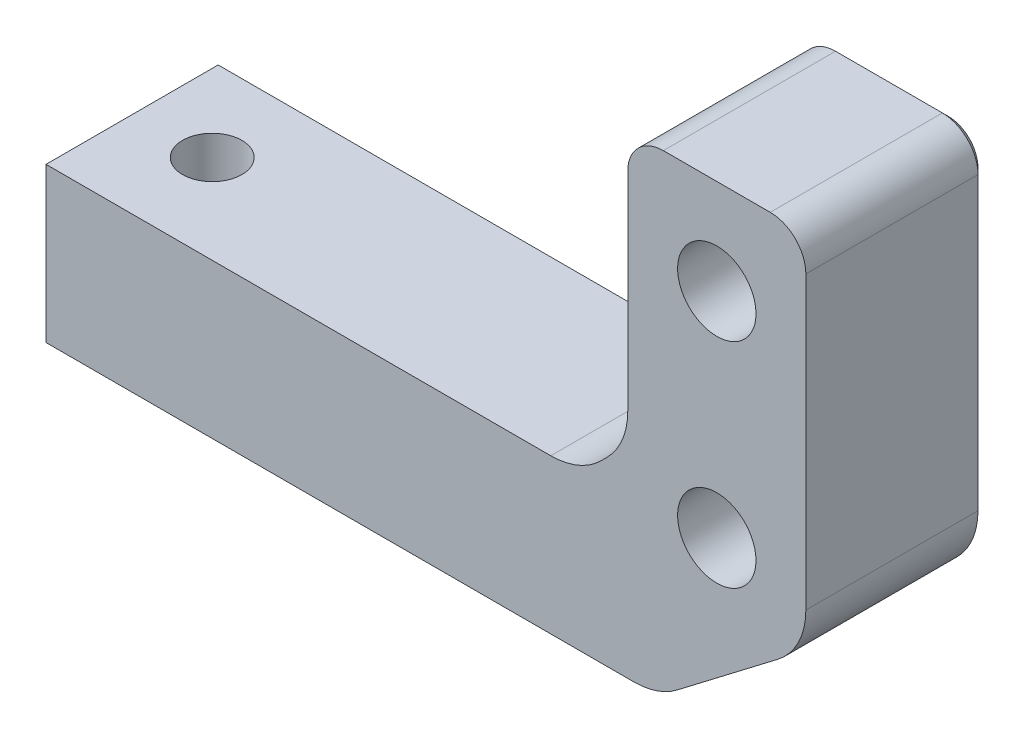
ISO-10303-21;
HEADER;
FILE_DESCRIPTION(('STEP AP214'),'2;1');
FILE_NAME('part.step','',(''),(''),'','','');
FILE_SCHEMA(('AUTOMOTIVE_DESIGN { 1 0 10303 214 1 1 1 1 }'));
ENDSEC;
DATA;
#1=APPLICATION_CONTEXT('core data for automotive mechanical design processes');
#2=APPLICATION_PROTOCOL_DEFINITION('international standard','automotive_design',2000,#1);
#3=PRODUCT_CONTEXT('',#1,'mechanical');
#4=PRODUCT('Part','Part','',(#3));
#5=PRODUCT_RELATED_PRODUCT_CATEGORY('part','',(#4));
#6=PRODUCT_DEFINITION_FORMATION('','',#4);
#7=PRODUCT_DEFINITION_CONTEXT('part definition',#1,'design');
#8=PRODUCT_DEFINITION('design','',#6,#7);
#9=PRODUCT_DEFINITION_SHAPE('','',#8);
#10=(LENGTH_UNIT() NAMED_UNIT(*) SI_UNIT(.MILLI.,.METRE.));
#11=(NAMED_UNIT(*) PLANE_ANGLE_UNIT() SI_UNIT($,.RADIAN.));
#12=(NAMED_UNIT(*) SI_UNIT($,.STERADIAN.) SOLID_ANGLE_UNIT());
#13=UNCERTAINTY_MEASURE_WITH_UNIT(LENGTH_MEASURE(1.E-05),#10,'distance_accuracy_value','');
#14=(GEOMETRIC_REPRESENTATION_CONTEXT(3) GLOBAL_UNCERTAINTY_ASSIGNED_CONTEXT((#13)) GLOBAL_UNIT_ASSIGNED_CONTEXT((#10,
#11,#12)) REPRESENTATION_CONTEXT('',''));
#15=CARTESIAN_POINT('',(0.,0.,0.));
#16=DIRECTION('',(0.,0.,1.));
#17=DIRECTION('',(1.,0.,0.));
#18=AXIS2_PLACEMENT_3D('',#15,#16,#17);
#19=CARTESIAN_POINT('',(19.014718625759,-13.832454105557,30.));
#20=DIRECTION('',(0.,0.,1.));
#21=DIRECTION('',(-1.,0.,0.));
#22=AXIS2_PLACEMENT_3D('',#19,#20,#21);
#23=PLANE('',#22);
#24=DIRECTION('',(0.,-1.,0.));
#25=VECTOR('',#24,1.);
#26=CARTESIAN_POINT('',(-30.4999999999976,-6.83245410555701,30.));
#27=LINE('',#26,#25);
#28=CARTESIAN_POINT('',(-30.4999999999976,-6.83245410555701,30.));
#29=VERTEX_POINT('',#28);
#30=CARTESIAN_POINT('',(-30.4999999999976,-19.832454105557,30.));
#31=VERTEX_POINT('',#30);
#32=EDGE_CURVE('E185',#29,#31,#27,.T.);
#33=ORIENTED_EDGE('',*,*,#32,.T.);
#34=DIRECTION('',(1.,0.,0.));
#35=VECTOR('',#34,1.);
#36=CARTESIAN_POINT('',(-30.4999999999976,-19.832454105557,30.));
#37=LINE('',#36,#35);
#38=CARTESIAN_POINT('',(19.014718625759,-19.832454105557,30.));
#39=VERTEX_POINT('',#38);
#40=EDGE_CURVE('E193',#31,#39,#37,.T.);
#41=ORIENTED_EDGE('',*,*,#40,.T.);
#42=CARTESIAN_POINT('',(19.014718625759,-13.832454105557,30.));
#43=DIRECTION('',(0.,0.,1.));
#44=DIRECTION('',(-1.,0.,0.));
#45=AXIS2_PLACEMENT_3D('',#42,#43,#44);
#46=CIRCLE('',#45,6.00000000000001);
#47=CARTESIAN_POINT('',(22.6581914357032,-18.599539785844,30.));
#48=VERTEX_POINT('',#47);
#49=EDGE_CURVE('E199',#39,#48,#46,.T.);
#50=ORIENTED_EDGE('',*,*,#49,.T.);
#51=DIRECTION('',(0.794514280047827,0.60724546832404,0.));
#52=VECTOR('',#51,1.);
#53=CARTESIAN_POINT('',(22.6581914357032,-18.599539785844,30.));
#54=LINE('',#53,#52);
#55=CARTESIAN_POINT('',(31.1434728099418,-12.1142584116054,30.));
#56=VERTEX_POINT('',#55);
#57=EDGE_CURVE('E214',#48,#56,#54,.T.);
#58=ORIENTED_EDGE('',*,*,#57,.T.);
#59=CARTESIAN_POINT('',(27.4999999999976,-7.34717273131841,30.));
#60=DIRECTION('',(0.,0.,1.));
#61=DIRECTION('',(1.,0.,0.));
#62=AXIS2_PLACEMENT_3D('',#59,#60,#61);
#63=CIRCLE('',#62,6.);
#64=CARTESIAN_POINT('',(33.4999999999976,-7.34717273131841,30.));
#65=VERTEX_POINT('',#64);
#66=EDGE_CURVE('E217',#56,#65,#63,.T.);
#67=ORIENTED_EDGE('',*,*,#66,.T.);
#68=DIRECTION('',(0.,1.,0.));
#69=VECTOR('',#68,1.);
#70=CARTESIAN_POINT('',(33.4999999999976,-7.34717273131841,30.));
#71=LINE('',#70,#69);
#72=CARTESIAN_POINT('',(33.4999999999976,17.167545894443,30.));
#73=VERTEX_POINT('',#72);
#74=EDGE_CURVE('E220',#65,#73,#71,.T.);
#75=ORIENTED_EDGE('',*,*,#74,.T.);
#76=CARTESIAN_POINT('',(30.4999999999976,17.167545894443,30.));
#77=DIRECTION('',(0.,0.,1.));
#78=DIRECTION('',(1.,0.,0.));
#79=AXIS2_PLACEMENT_3D('',#76,#77,#78);
#80=CIRCLE('',#79,3.);
#81=CARTESIAN_POINT('',(30.4999999999976,20.167545894443,30.));
#82=VERTEX_POINT('',#81);
#83=EDGE_CURVE('E223',#73,#82,#80,.T.);
#84=ORIENTED_EDGE('',*,*,#83,.T.);
#85=DIRECTION('',(-1.,0.,0.));
#86=VECTOR('',#85,1.);
#87=CARTESIAN_POINT('',(30.4999999999976,20.167545894443,30.));
#88=LINE('',#87,#86);
#89=CARTESIAN_POINT('',(21.4999999999976,20.167545894443,30.));
#90=VERTEX_POINT('',#89);
#91=EDGE_CURVE('E226',#82,#90,#88,.T.);
#92=ORIENTED_EDGE('',*,*,#91,.T.);
#93=CARTESIAN_POINT('',(21.4999999999976,17.167545894443,30.));
#94=DIRECTION('',(0.,0.,1.));
#95=DIRECTION('',(1.,0.,0.));
#96=AXIS2_PLACEMENT_3D('',#93,#94,#95);
#97=CIRCLE('',#96,3.);
#98=CARTESIAN_POINT('',(18.4999999999976,17.167545894443,30.));
#99=VERTEX_POINT('',#98);
#100=EDGE_CURVE('E229',#90,#99,#97,.T.);
#101=ORIENTED_EDGE('',*,*,#100,.T.);
#102=DIRECTION('',(0.,-1.,0.));
#103=VECTOR('',#102,1.);
#104=CARTESIAN_POINT('',(18.4999999999976,-0.347172731318424,30.));
#105=LINE('',#104,#103);
#106=CARTESIAN_POINT('',(18.4999999999976,-0.347172731318424,30.));
#107=VERTEX_POINT('',#106);
#108=EDGE_CURVE('E232',#99,#107,#105,.T.);
#109=ORIENTED_EDGE('',*,*,#108,.T.);
#110=CARTESIAN_POINT('',(12.4999999999976,-0.347172731318424,30.));
#111=DIRECTION('',(0.,0.,-1.));
#112=DIRECTION('',(1.,0.,0.));
#113=AXIS2_PLACEMENT_3D('',#110,#111,#112);
#114=CIRCLE('',#113,6.);
#115=CARTESIAN_POINT('',(16.7426406871169,-4.58981341843767,30.));
#116=VERTEX_POINT('',#115);
#117=EDGE_CURVE('E235',#107,#116,#114,.T.);
#118=ORIENTED_EDGE('',*,*,#117,.T.);
#119=DIRECTION('',(-0.707106781186538,-0.707106781186557,0.));
#120=VECTOR('',#119,1.);
#121=CARTESIAN_POINT('',(16.2573593128783,-5.07509479267625,30.));
#122=LINE('',#121,#120);
#123=CARTESIAN_POINT('',(16.2573593128783,-5.07509479267625,30.));
#124=VERTEX_POINT('',#123);
#125=EDGE_CURVE('E238',#116,#124,#122,.T.);
#126=ORIENTED_EDGE('',*,*,#125,.T.);
#127=CARTESIAN_POINT('',(12.014718625759,-0.832454105557007,30.));
#128=DIRECTION('',(0.,0.,-1.));
#129=DIRECTION('',(-1.,0.,0.));
#130=AXIS2_PLACEMENT_3D('',#127,#128,#129);
#131=CIRCLE('',#130,6.);
#132=CARTESIAN_POINT('',(12.014718625759,-6.83245410555701,30.));
#133=VERTEX_POINT('',#132);
#134=EDGE_CURVE('E241',#124,#133,#131,.T.);
#135=ORIENTED_EDGE('',*,*,#134,.T.);
#136=DIRECTION('',(-1.,0.,0.));
#137=VECTOR('',#136,1.);
#138=CARTESIAN_POINT('',(-30.4999999999976,-6.83245410555701,30.));
#139=LINE('',#138,#137);
#140=EDGE_CURVE('E205',#133,#29,#139,.T.);
#141=ORIENTED_EDGE('',*,*,#140,.T.);
#142=EDGE_LOOP('',(#33,#41,#50,#58,#67,#75,#84,#92,#101,#109,#118,#126,#135,#141));
#143=FACE_BOUND('',#142,.T.);
#144=CARTESIAN_POINT('',(25.9999999999976,-5.83245410555701,30.));
#145=DIRECTION('',(0.,0.,1.));
#146=DIRECTION('',(1.,0.,0.));
#147=AXIS2_PLACEMENT_3D('',#144,#145,#146);
#148=CIRCLE('',#147,3.3);
#149=CARTESIAN_POINT('',(29.2999999999976,-5.83245410555701,30.));
#150=VERTEX_POINT('',#149);
#151=EDGE_CURVE('E206',#150,#150,#148,.T.);
#152=ORIENTED_EDGE('',*,*,#151,.F.);
#153=EDGE_LOOP('',(#152));
#154=FACE_BOUND('',#153,.T.);
#155=CARTESIAN_POINT('',(25.9999999999976,12.167545894443,30.));
#156=DIRECTION('',(0.,0.,1.));
#157=DIRECTION('',(1.,0.,0.));
#158=AXIS2_PLACEMENT_3D('',#155,#156,#157);
#159=CIRCLE('',#158,3.3);
#160=CARTESIAN_POINT('',(29.2999999999976,12.167545894443,30.));
#161=VERTEX_POINT('',#160);
#162=EDGE_CURVE('E394',#161,#161,#159,.T.);
#163=ORIENTED_EDGE('',*,*,#162,.F.);
#164=EDGE_LOOP('',(#163));
#165=FACE_BOUND('',#164,.T.);
#166=ADVANCED_FACE('F34',(#143,#154,#165),#23,.T.);
#167=CARTESIAN_POINT('',(19.014718625759,-13.832454105557,15.));
#168=DIRECTION('',(0.,0.,1.));
#169=DIRECTION('',(-1.,0.,0.));
#170=AXIS2_PLACEMENT_3D('',#167,#168,#169);
#171=PLANE('',#170);
#172=CARTESIAN_POINT('',(25.9999999999976,12.167545894443,15.));
#173=DIRECTION('',(0.,0.,-1.));
#174=DIRECTION('',(-1.,0.,0.));
#175=AXIS2_PLACEMENT_3D('',#172,#173,#174);
#176=CIRCLE('',#175,6.);
#177=CARTESIAN_POINT('',(19.9999999999976,12.167545894443,15.));
#178=VERTEX_POINT('',#177);
#179=EDGE_CURVE('E314',#178,#178,#176,.T.);
#180=ORIENTED_EDGE('',*,*,#179,.F.);
#181=EDGE_LOOP('',(#180));
#182=FACE_BOUND('',#181,.T.);
#183=CARTESIAN_POINT('',(25.9999999999976,-5.83245410555701,15.));
#184=DIRECTION('',(0.,0.,-1.));
#185=DIRECTION('',(-1.,0.,0.));
#186=AXIS2_PLACEMENT_3D('',#183,#184,#185);
#187=CIRCLE('',#186,5.99999999999999);
#188=CARTESIAN_POINT('',(19.9999999999976,-5.83245410555701,15.));
#189=VERTEX_POINT('',#188);
#190=EDGE_CURVE('E311',#189,#189,#187,.T.);
#191=ORIENTED_EDGE('',*,*,#190,.F.);
#192=EDGE_LOOP('',(#191));
#193=FACE_BOUND('',#192,.T.);
#194=DIRECTION('',(0.,-1.,0.));
#195=VECTOR('',#194,1.);
#196=CARTESIAN_POINT('',(-29.9999999999976,-13.832454105557,15.));
#197=LINE('',#196,#195);
#198=CARTESIAN_POINT('',(-29.9999999999976,-7.33245410555701,15.));
#199=VERTEX_POINT('',#198);
#200=CARTESIAN_POINT('',(-29.9999999999976,-19.332454105557,15.));
#201=VERTEX_POINT('',#200);
#202=EDGE_CURVE('E273',#199,#201,#197,.T.);
#203=ORIENTED_EDGE('',*,*,#202,.F.);
#204=DIRECTION('',(-1.,0.,0.));
#205=VECTOR('',#204,1.);
#206=CARTESIAN_POINT('',(19.014718625759,-7.33245410555701,15.));
#207=LINE('',#206,#205);
#208=CARTESIAN_POINT('',(12.014718625759,-7.33245410555701,15.));
#209=VERTEX_POINT('',#208);
#210=EDGE_CURVE('E271',#209,#199,#207,.T.);
#211=ORIENTED_EDGE('',*,*,#210,.F.);
#212=CARTESIAN_POINT('',(12.014718625759,-0.832454105557007,15.));
#213=DIRECTION('',(0.,0.,-1.));
#214=DIRECTION('',(-1.,0.,0.));
#215=AXIS2_PLACEMENT_3D('',#212,#213,#214);
#216=CIRCLE('',#215,6.5);
#217=CARTESIAN_POINT('',(16.6109127034716,-5.42864818326952,15.));
#218=VERTEX_POINT('',#217);
#219=EDGE_CURVE('E276',#218,#209,#216,.T.);
#220=ORIENTED_EDGE('',*,*,#219,.F.);
#221=DIRECTION('',(-0.707106781186538,-0.707106781186557,0.));
#222=VECTOR('',#221,1.);
#223=CARTESIAN_POINT('',(13.6109127034715,-8.42864818326968,15.));
#224=LINE('',#223,#222);
#225=CARTESIAN_POINT('',(17.0961940777102,-4.94336680903094,15.));
#226=VERTEX_POINT('',#225);
#227=EDGE_CURVE('E278',#226,#218,#224,.T.);
#228=ORIENTED_EDGE('',*,*,#227,.F.);
#229=CARTESIAN_POINT('',(12.4999999999976,-0.347172731318424,15.));
#230=DIRECTION('',(0.,0.,-1.));
#231=DIRECTION('',(-1.,0.,0.));
#232=AXIS2_PLACEMENT_3D('',#229,#230,#231);
#233=CIRCLE('',#232,6.5);
#234=CARTESIAN_POINT('',(18.9999999999976,-0.347172731318424,15.));
#235=VERTEX_POINT('',#234);
#236=EDGE_CURVE('E281',#235,#226,#233,.T.);
#237=ORIENTED_EDGE('',*,*,#236,.F.);
#238=DIRECTION('',(0.,-1.,0.));
#239=VECTOR('',#238,1.);
#240=CARTESIAN_POINT('',(18.9999999999976,-13.832454105557,15.));
#241=LINE('',#240,#239);
#242=CARTESIAN_POINT('',(18.9999999999976,17.167545894443,15.));
#243=VERTEX_POINT('',#242);
#244=EDGE_CURVE('E284',#243,#235,#241,.T.);
#245=ORIENTED_EDGE('',*,*,#244,.F.);
#246=CARTESIAN_POINT('',(21.4999999999976,17.167545894443,15.));
#247=DIRECTION('',(0.,0.,-1.));
#248=DIRECTION('',(-1.,0.,0.));
#249=AXIS2_PLACEMENT_3D('',#246,#247,#248);
#250=CIRCLE('',#249,2.5);
#251=CARTESIAN_POINT('',(21.4999999999976,19.667545894443,15.));
#252=VERTEX_POINT('',#251);
#253=EDGE_CURVE('E287',#252,#243,#250,.F.);
#254=ORIENTED_EDGE('',*,*,#253,.F.);
#255=DIRECTION('',(-1.,0.,0.));
#256=VECTOR('',#255,1.);
#257=CARTESIAN_POINT('',(19.014718625759,19.667545894443,15.));
#258=LINE('',#257,#256);
#259=CARTESIAN_POINT('',(30.4999999999976,19.667545894443,15.));
#260=VERTEX_POINT('',#259);
#261=EDGE_CURVE('E290',#260,#252,#258,.T.);
#262=ORIENTED_EDGE('',*,*,#261,.F.);
#263=CARTESIAN_POINT('',(30.4999999999976,17.167545894443,15.));
#264=DIRECTION('',(0.,0.,-1.));
#265=DIRECTION('',(-1.,0.,0.));
#266=AXIS2_PLACEMENT_3D('',#263,#264,#265);
#267=CIRCLE('',#266,2.5);
#268=CARTESIAN_POINT('',(32.9999999999976,17.167545894443,15.));
#269=VERTEX_POINT('',#268);
#270=EDGE_CURVE('E293',#269,#260,#267,.F.);
#271=ORIENTED_EDGE('',*,*,#270,.F.);
#272=DIRECTION('',(0.,1.,0.));
#273=VECTOR('',#272,1.);
#274=CARTESIAN_POINT('',(32.9999999999976,-13.832454105557,15.));
#275=LINE('',#274,#273);
#276=CARTESIAN_POINT('',(32.9999999999976,-7.34717273131841,15.));
#277=VERTEX_POINT('',#276);
#278=EDGE_CURVE('E296',#277,#269,#275,.T.);
#279=ORIENTED_EDGE('',*,*,#278,.F.);
#280=CARTESIAN_POINT('',(27.4999999999976,-7.34717273131841,15.));
#281=DIRECTION('',(0.,0.,-1.));
#282=DIRECTION('',(-1.,0.,0.));
#283=AXIS2_PLACEMENT_3D('',#280,#281,#282);
#284=CIRCLE('',#283,5.5);
#285=CARTESIAN_POINT('',(30.8398500757798,-11.7170012715815,15.));
#286=VERTEX_POINT('',#285);
#287=EDGE_CURVE('E299',#286,#277,#284,.F.);
#288=ORIENTED_EDGE('',*,*,#287,.F.);
#289=DIRECTION('',(0.794514280047827,0.60724546832404,0.));
#290=VECTOR('',#289,1.);
#291=CARTESIAN_POINT('',(22.3545687015412,-18.2022826458201,15.));
#292=LINE('',#291,#290);
#293=CARTESIAN_POINT('',(22.3545687015412,-18.2022826458201,15.));
#294=VERTEX_POINT('',#293);
#295=EDGE_CURVE('E302',#294,#286,#292,.T.);
#296=ORIENTED_EDGE('',*,*,#295,.F.);
#297=CARTESIAN_POINT('',(19.014718625759,-13.832454105557,15.));
#298=DIRECTION('',(0.,0.,-1.));
#299=DIRECTION('',(-1.,0.,0.));
#300=AXIS2_PLACEMENT_3D('',#297,#298,#299);
#301=CIRCLE('',#300,5.50000000000001);
#302=CARTESIAN_POINT('',(19.014718625759,-19.332454105557,15.));
#303=VERTEX_POINT('',#302);
#304=EDGE_CURVE('E305',#303,#294,#301,.F.);
#305=ORIENTED_EDGE('',*,*,#304,.F.);
#306=DIRECTION('',(1.,0.,0.));
#307=VECTOR('',#306,1.);
#308=CARTESIAN_POINT('',(19.014718625759,-19.332454105557,15.));
#309=LINE('',#308,#307);
#310=EDGE_CURVE('E308',#201,#303,#309,.T.);
#311=ORIENTED_EDGE('',*,*,#310,.F.);
#312=EDGE_LOOP('',(#203,#211,#220,#228,#237,#245,#254,#262,#271,#279,#288,#296,#305,#311));
#313=FACE_BOUND('',#312,.T.);
#314=ADVANCED_FACE('F420',(#182,#193,#313),#171,.F.);
#315=CARTESIAN_POINT('',(-30.4999999999976,-6.83245410555701,15.));
#316=DIRECTION('',(1.,0.,0.));
#317=DIRECTION('',(0.,0.,1.));
#318=AXIS2_PLACEMENT_3D('',#315,#316,#317);
#319=PLANE('',#318);
#320=DIRECTION('',(0.,0.,1.));
#321=VECTOR('',#320,1.);
#322=CARTESIAN_POINT('',(-30.4999999999976,-19.832454105557,15.));
#323=LINE('',#322,#321);
#324=CARTESIAN_POINT('',(-30.4999999999976,-19.832454105557,15.5));
#325=VERTEX_POINT('',#324);
#326=EDGE_CURVE('E180',#325,#31,#323,.T.);
#327=ORIENTED_EDGE('',*,*,#326,.T.);
#328=ORIENTED_EDGE('',*,*,#32,.F.);
#329=DIRECTION('',(0.,0.,1.));
#330=VECTOR('',#329,1.);
#331=CARTESIAN_POINT('',(-30.4999999999976,-6.83245410555701,15.));
#332=LINE('',#331,#330);
#333=CARTESIAN_POINT('',(-30.4999999999976,-6.83245410555701,15.5));
#334=VERTEX_POINT('',#333);
#335=EDGE_CURVE('E244',#334,#29,#332,.T.);
#336=ORIENTED_EDGE('',*,*,#335,.F.);
#337=DIRECTION('',(0.,1.,0.));
#338=VECTOR('',#337,1.);
#339=CARTESIAN_POINT('',(-30.4999999999976,-6.83245410555701,15.5));
#340=LINE('',#339,#338);
#341=EDGE_CURVE('E43',#325,#334,#340,.T.);
#342=ORIENTED_EDGE('',*,*,#341,.F.);
#343=EDGE_LOOP('',(#327,#328,#336,#342));
#344=FACE_BOUND('',#343,.T.);
#345=ADVANCED_FACE('F182',(#344),#319,.F.);
#346=CARTESIAN_POINT('',(-30.4999999999976,-19.832454105557,15.));
#347=DIRECTION('',(0.,1.,0.));
#348=DIRECTION('',(0.,0.,-1.));
#349=AXIS2_PLACEMENT_3D('',#346,#347,#348);
#350=PLANE('',#349);
#351=CARTESIAN_POINT('',(-23.9999999999976,-19.832454105557,22.5));
#352=DIRECTION('',(0.,-1.,0.));
#353=DIRECTION('',(0.,0.,-1.));
#354=AXIS2_PLACEMENT_3D('',#351,#352,#353);
#355=CIRCLE('',#354,2.5);
#356=CARTESIAN_POINT('',(-23.9999999999976,-19.832454105557,20.));
#357=VERTEX_POINT('',#356);
#358=EDGE_CURVE('E381',#357,#357,#355,.T.);
#359=ORIENTED_EDGE('',*,*,#358,.F.);
#360=EDGE_LOOP('',(#359));
#361=FACE_BOUND('',#360,.T.);
#362=DIRECTION('',(0.,0.,1.));
#363=VECTOR('',#362,1.);
#364=CARTESIAN_POINT('',(19.014718625759,-19.832454105557,15.));
#365=LINE('',#364,#363);
#366=CARTESIAN_POINT('',(19.014718625759,-19.832454105557,15.5));
#367=VERTEX_POINT('',#366);
#368=EDGE_CURVE('E190',#367,#39,#365,.T.);
#369=ORIENTED_EDGE('',*,*,#368,.T.);
#370=ORIENTED_EDGE('',*,*,#40,.F.);
#371=ORIENTED_EDGE('',*,*,#326,.F.);
#372=DIRECTION('',(-1.,0.,0.));
#373=VECTOR('',#372,1.);
#374=CARTESIAN_POINT('',(-30.4999999999976,-19.832454105557,15.5));
#375=LINE('',#374,#373);
#376=EDGE_CURVE('E320',#367,#325,#375,.T.);
#377=ORIENTED_EDGE('',*,*,#376,.F.);
#378=EDGE_LOOP('',(#369,#370,#371,#377));
#379=FACE_BOUND('',#378,.T.);
#380=ADVANCED_FACE('F194',(#361,#379),#350,.F.);
#381=CARTESIAN_POINT('',(19.014718625759,-13.832454105557,15.));
#382=DIRECTION('',(0.,0.,1.));
#383=DIRECTION('',(-1.,0.,0.));
#384=AXIS2_PLACEMENT_3D('',#381,#382,#383);
#385=CYLINDRICAL_SURFACE('',#384,6.00000000000001);
#386=DIRECTION('',(0.,0.,1.));
#387=VECTOR('',#386,1.);
#388=CARTESIAN_POINT('',(22.6581914357032,-18.599539785844,15.));
#389=LINE('',#388,#387);
#390=CARTESIAN_POINT('',(22.6581914357032,-18.599539785844,15.5));
#391=VERTEX_POINT('',#390);
#392=EDGE_CURVE('E266',#391,#48,#389,.T.);
#393=ORIENTED_EDGE('',*,*,#392,.T.);
#394=ORIENTED_EDGE('',*,*,#49,.F.);
#395=ORIENTED_EDGE('',*,*,#368,.F.);
#396=CARTESIAN_POINT('',(19.014718625759,-13.832454105557,15.5));
#397=DIRECTION('',(0.,0.,-1.));
#398=DIRECTION('',(-1.,0.,0.));
#399=AXIS2_PLACEMENT_3D('',#396,#397,#398);
#400=CIRCLE('',#399,6.00000000000001);
#401=EDGE_CURVE('E323',#391,#367,#400,.T.);
#402=ORIENTED_EDGE('',*,*,#401,.F.);
#403=EDGE_LOOP('',(#393,#394,#395,#402));
#404=FACE_BOUND('',#403,.T.);
#405=ADVANCED_FACE('F465',(#404),#385,.T.);
#406=CARTESIAN_POINT('',(22.6581914357032,-18.599539785844,15.));
#407=DIRECTION('',(-0.60724546832404,0.794514280047827,0.));
#408=DIRECTION('',(-0.794514280047828,-0.60724546832404,0.));
#409=AXIS2_PLACEMENT_3D('',#406,#407,#408);
#410=PLANE('',#409);
#411=DIRECTION('',(0.,0.,1.));
#412=VECTOR('',#411,1.);
#413=CARTESIAN_POINT('',(31.1434728099418,-12.1142584116054,15.));
#414=LINE('',#413,#412);
#415=CARTESIAN_POINT('',(31.1434728099418,-12.1142584116054,15.5));
#416=VERTEX_POINT('',#415);
#417=EDGE_CURVE('E264',#416,#56,#414,.T.);
#418=ORIENTED_EDGE('',*,*,#417,.T.);
#419=ORIENTED_EDGE('',*,*,#57,.F.);
#420=ORIENTED_EDGE('',*,*,#392,.F.);
#421=DIRECTION('',(-0.794514280047828,-0.60724546832404,0.));
#422=VECTOR('',#421,1.);
#423=CARTESIAN_POINT('',(22.6581914357032,-18.599539785844,15.5));
#424=LINE('',#423,#422);
#425=EDGE_CURVE('E326',#416,#391,#424,.T.);
#426=ORIENTED_EDGE('',*,*,#425,.F.);
#427=EDGE_LOOP('',(#418,#419,#420,#426));
#428=FACE_BOUND('',#427,.T.);
#429=ADVANCED_FACE('F461',(#428),#410,.F.);
#430=CARTESIAN_POINT('',(27.4999999999976,-7.34717273131841,15.));
#431=DIRECTION('',(0.,0.,1.));
#432=DIRECTION('',(-1.,0.,0.));
#433=AXIS2_PLACEMENT_3D('',#430,#431,#432);
#434=CYLINDRICAL_SURFACE('',#433,6.);
#435=DIRECTION('',(0.,0.,1.));
#436=VECTOR('',#435,1.);
#437=CARTESIAN_POINT('',(33.4999999999976,-7.34717273131841,15.));
#438=LINE('',#437,#436);
#439=CARTESIAN_POINT('',(33.4999999999976,-7.34717273131841,15.5));
#440=VERTEX_POINT('',#439);
#441=EDGE_CURVE('E262',#440,#65,#438,.T.);
#442=ORIENTED_EDGE('',*,*,#441,.T.);
#443=ORIENTED_EDGE('',*,*,#66,.F.);
#444=ORIENTED_EDGE('',*,*,#417,.F.);
#445=CARTESIAN_POINT('',(27.4999999999976,-7.34717273131841,15.5));
#446=DIRECTION('',(0.,0.,-1.));
#447=DIRECTION('',(-1.,0.,0.));
#448=AXIS2_PLACEMENT_3D('',#445,#446,#447);
#449=CIRCLE('',#448,6.);
#450=EDGE_CURVE('E329',#440,#416,#449,.T.);
#451=ORIENTED_EDGE('',*,*,#450,.F.);
#452=EDGE_LOOP('',(#442,#443,#444,#451));
#453=FACE_BOUND('',#452,.T.);
#454=ADVANCED_FACE('F457',(#453),#434,.T.);
#455=CARTESIAN_POINT('',(33.4999999999976,-7.34717273131841,15.));
#456=DIRECTION('',(-1.,0.,0.));
#457=DIRECTION('',(0.,0.,-1.));
#458=AXIS2_PLACEMENT_3D('',#455,#456,#457);
#459=PLANE('',#458);
#460=DIRECTION('',(0.,0.,1.));
#461=VECTOR('',#460,1.);
#462=CARTESIAN_POINT('',(33.4999999999976,17.167545894443,15.));
#463=LINE('',#462,#461);
#464=CARTESIAN_POINT('',(33.4999999999976,17.167545894443,15.5));
#465=VERTEX_POINT('',#464);
#466=EDGE_CURVE('E260',#465,#73,#463,.T.);
#467=ORIENTED_EDGE('',*,*,#466,.T.);
#468=ORIENTED_EDGE('',*,*,#74,.F.);
#469=ORIENTED_EDGE('',*,*,#441,.F.);
#470=DIRECTION('',(0.,-1.,0.));
#471=VECTOR('',#470,1.);
#472=CARTESIAN_POINT('',(33.4999999999976,-7.34717273131841,15.5));
#473=LINE('',#472,#471);
#474=EDGE_CURVE('E332',#465,#440,#473,.T.);
#475=ORIENTED_EDGE('',*,*,#474,.F.);
#476=EDGE_LOOP('',(#467,#468,#469,#475));
#477=FACE_BOUND('',#476,.T.);
#478=ADVANCED_FACE('F453',(#477),#459,.F.);
#479=CARTESIAN_POINT('',(30.4999999999976,17.167545894443,15.));
#480=DIRECTION('',(0.,0.,1.));
#481=DIRECTION('',(-1.,0.,0.));
#482=AXIS2_PLACEMENT_3D('',#479,#480,#481);
#483=CYLINDRICAL_SURFACE('',#482,3.);
#484=DIRECTION('',(0.,0.,1.));
#485=VECTOR('',#484,1.);
#486=CARTESIAN_POINT('',(30.4999999999976,20.167545894443,15.));
#487=LINE('',#486,#485);
#488=CARTESIAN_POINT('',(30.4999999999976,20.167545894443,15.5));
#489=VERTEX_POINT('',#488);
#490=EDGE_CURVE('E258',#489,#82,#487,.T.);
#491=ORIENTED_EDGE('',*,*,#490,.T.);
#492=ORIENTED_EDGE('',*,*,#83,.F.);
#493=ORIENTED_EDGE('',*,*,#466,.F.);
#494=CARTESIAN_POINT('',(30.4999999999976,17.167545894443,15.5));
#495=DIRECTION('',(0.,0.,-1.));
#496=DIRECTION('',(-1.,0.,0.));
#497=AXIS2_PLACEMENT_3D('',#494,#495,#496);
#498=CIRCLE('',#497,3.);
#499=EDGE_CURVE('E335',#489,#465,#498,.T.);
#500=ORIENTED_EDGE('',*,*,#499,.F.);
#501=EDGE_LOOP('',(#491,#492,#493,#500));
#502=FACE_BOUND('',#501,.T.);
#503=ADVANCED_FACE('F449',(#502),#483,.T.);
#504=CARTESIAN_POINT('',(30.4999999999976,20.167545894443,15.));
#505=DIRECTION('',(0.,-1.,0.));
#506=DIRECTION('',(0.,0.,1.));
#507=AXIS2_PLACEMENT_3D('',#504,#505,#506);
#508=PLANE('',#507);
#509=DIRECTION('',(0.,0.,1.));
#510=VECTOR('',#509,1.);
#511=CARTESIAN_POINT('',(21.4999999999976,20.167545894443,15.));
#512=LINE('',#511,#510);
#513=CARTESIAN_POINT('',(21.4999999999976,20.167545894443,15.5));
#514=VERTEX_POINT('',#513);
#515=EDGE_CURVE('E256',#514,#90,#512,.T.);
#516=ORIENTED_EDGE('',*,*,#515,.T.);
#517=ORIENTED_EDGE('',*,*,#91,.F.);
#518=ORIENTED_EDGE('',*,*,#490,.F.);
#519=DIRECTION('',(1.,0.,0.));
#520=VECTOR('',#519,1.);
#521=CARTESIAN_POINT('',(30.4999999999976,20.167545894443,15.5));
#522=LINE('',#521,#520);
#523=EDGE_CURVE('E338',#514,#489,#522,.T.);
#524=ORIENTED_EDGE('',*,*,#523,.F.);
#525=EDGE_LOOP('',(#516,#517,#518,#524));
#526=FACE_BOUND('',#525,.T.);
#527=ADVANCED_FACE('F445',(#526),#508,.F.);
#528=CARTESIAN_POINT('',(21.4999999999976,17.167545894443,15.));
#529=DIRECTION('',(0.,0.,1.));
#530=DIRECTION('',(-1.,0.,0.));
#531=AXIS2_PLACEMENT_3D('',#528,#529,#530);
#532=CYLINDRICAL_SURFACE('',#531,3.);
#533=DIRECTION('',(0.,0.,1.));
#534=VECTOR('',#533,1.);
#535=CARTESIAN_POINT('',(18.4999999999976,17.167545894443,15.));
#536=LINE('',#535,#534);
#537=CARTESIAN_POINT('',(18.4999999999976,17.167545894443,15.5));
#538=VERTEX_POINT('',#537);
#539=EDGE_CURVE('E254',#538,#99,#536,.T.);
#540=ORIENTED_EDGE('',*,*,#539,.T.);
#541=ORIENTED_EDGE('',*,*,#100,.F.);
#542=ORIENTED_EDGE('',*,*,#515,.F.);
#543=CARTESIAN_POINT('',(21.4999999999976,17.167545894443,15.5));
#544=DIRECTION('',(0.,0.,-1.));
#545=DIRECTION('',(-1.,0.,0.));
#546=AXIS2_PLACEMENT_3D('',#543,#544,#545);
#547=CIRCLE('',#546,3.);
#548=EDGE_CURVE('E341',#538,#514,#547,.T.);
#549=ORIENTED_EDGE('',*,*,#548,.F.);
#550=EDGE_LOOP('',(#540,#541,#542,#549));
#551=FACE_BOUND('',#550,.T.);
#552=ADVANCED_FACE('F441',(#551),#532,.T.);
#553=CARTESIAN_POINT('',(18.4999999999976,-0.347172731318424,15.));
#554=DIRECTION('',(1.,0.,0.));
#555=DIRECTION('',(0.,1.,0.));
#556=AXIS2_PLACEMENT_3D('',#553,#554,#555);
#557=PLANE('',#556);
#558=DIRECTION('',(0.,0.,1.));
#559=VECTOR('',#558,1.);
#560=CARTESIAN_POINT('',(18.4999999999976,-0.347172731318424,15.));
#561=LINE('',#560,#559);
#562=CARTESIAN_POINT('',(18.4999999999976,-0.347172731318424,15.5));
#563=VERTEX_POINT('',#562);
#564=EDGE_CURVE('E252',#563,#107,#561,.T.);
#565=ORIENTED_EDGE('',*,*,#564,.T.);
#566=ORIENTED_EDGE('',*,*,#108,.F.);
#567=ORIENTED_EDGE('',*,*,#539,.F.);
#568=DIRECTION('',(0.,1.,0.));
#569=VECTOR('',#568,1.);
#570=CARTESIAN_POINT('',(18.4999999999976,-0.347172731318424,15.5));
#571=LINE('',#570,#569);
#572=EDGE_CURVE('E344',#563,#538,#571,.T.);
#573=ORIENTED_EDGE('',*,*,#572,.F.);
#574=EDGE_LOOP('',(#565,#566,#567,#573));
#575=FACE_BOUND('',#574,.T.);
#576=ADVANCED_FACE('F437',(#575),#557,.F.);
#577=CARTESIAN_POINT('',(12.4999999999976,-0.347172731318424,15.));
#578=DIRECTION('',(0.,0.,1.));
#579=DIRECTION('',(-1.,0.,0.));
#580=AXIS2_PLACEMENT_3D('',#577,#578,#579);
#581=CYLINDRICAL_SURFACE('',#580,6.);
#582=DIRECTION('',(0.,0.,1.));
#583=VECTOR('',#582,1.);
#584=CARTESIAN_POINT('',(16.7426406871169,-4.58981341843767,15.));
#585=LINE('',#584,#583);
#586=CARTESIAN_POINT('',(16.7426406871169,-4.58981341843767,15.5));
#587=VERTEX_POINT('',#586);
#588=EDGE_CURVE('E250',#587,#116,#585,.T.);
#589=ORIENTED_EDGE('',*,*,#588,.T.);
#590=ORIENTED_EDGE('',*,*,#117,.F.);
#591=ORIENTED_EDGE('',*,*,#564,.F.);
#592=CARTESIAN_POINT('',(12.4999999999976,-0.347172731318424,15.5));
#593=DIRECTION('',(0.,0.,-1.));
#594=DIRECTION('',(-1.,0.,0.));
#595=AXIS2_PLACEMENT_3D('',#592,#593,#594);
#596=CIRCLE('',#595,6.);
#597=EDGE_CURVE('E347',#587,#563,#596,.F.);
#598=ORIENTED_EDGE('',*,*,#597,.F.);
#599=EDGE_LOOP('',(#589,#590,#591,#598));
#600=FACE_BOUND('',#599,.T.);
#601=ADVANCED_FACE('F433',(#600),#581,.F.);
#602=CARTESIAN_POINT('',(16.2573593128783,-5.07509479267625,15.));
#603=DIRECTION('',(0.707106781186557,-0.707106781186538,0.));
#604=DIRECTION('',(0.707106781186538,0.707106781186557,0.));
#605=AXIS2_PLACEMENT_3D('',#602,#603,#604);
#606=PLANE('',#605);
#607=DIRECTION('',(0.,0.,1.));
#608=VECTOR('',#607,1.);
#609=CARTESIAN_POINT('',(16.2573593128783,-5.07509479267625,15.));
#610=LINE('',#609,#608);
#611=CARTESIAN_POINT('',(16.2573593128783,-5.07509479267625,15.5));
#612=VERTEX_POINT('',#611);
#613=EDGE_CURVE('E248',#612,#124,#610,.T.);
#614=ORIENTED_EDGE('',*,*,#613,.T.);
#615=ORIENTED_EDGE('',*,*,#125,.F.);
#616=ORIENTED_EDGE('',*,*,#588,.F.);
#617=DIRECTION('',(0.707106781186538,0.707106781186557,0.));
#618=VECTOR('',#617,1.);
#619=CARTESIAN_POINT('',(16.2573593128783,-5.07509479267625,15.5));
#620=LINE('',#619,#618);
#621=EDGE_CURVE('E350',#612,#587,#620,.T.);
#622=ORIENTED_EDGE('',*,*,#621,.F.);
#623=EDGE_LOOP('',(#614,#615,#616,#622));
#624=FACE_BOUND('',#623,.T.);
#625=ADVANCED_FACE('F429',(#624),#606,.F.);
#626=CARTESIAN_POINT('',(12.014718625759,-0.832454105557007,15.));
#627=DIRECTION('',(0.,0.,1.));
#628=DIRECTION('',(-1.,0.,0.));
#629=AXIS2_PLACEMENT_3D('',#626,#627,#628);
#630=CYLINDRICAL_SURFACE('',#629,6.);
#631=DIRECTION('',(0.,0.,1.));
#632=VECTOR('',#631,1.);
#633=CARTESIAN_POINT('',(12.014718625759,-6.83245410555701,15.));
#634=LINE('',#633,#632);
#635=CARTESIAN_POINT('',(12.014718625759,-6.83245410555701,15.5));
#636=VERTEX_POINT('',#635);
#637=EDGE_CURVE('E246',#636,#133,#634,.T.);
#638=ORIENTED_EDGE('',*,*,#637,.T.);
#639=ORIENTED_EDGE('',*,*,#134,.F.);
#640=ORIENTED_EDGE('',*,*,#613,.F.);
#641=CARTESIAN_POINT('',(12.014718625759,-0.832454105557007,15.5));
#642=DIRECTION('',(0.,0.,-1.));
#643=DIRECTION('',(-1.,0.,0.));
#644=AXIS2_PLACEMENT_3D('',#641,#642,#643);
#645=CIRCLE('',#644,6.);
#646=EDGE_CURVE('E353',#636,#612,#645,.F.);
#647=ORIENTED_EDGE('',*,*,#646,.F.);
#648=EDGE_LOOP('',(#638,#639,#640,#647));
#649=FACE_BOUND('',#648,.T.);
#650=ADVANCED_FACE('F416',(#649),#630,.F.);
#651=CARTESIAN_POINT('',(-30.4999999999976,-6.83245410555701,15.));
#652=DIRECTION('',(0.,-1.,0.));
#653=DIRECTION('',(0.,0.,1.));
#654=AXIS2_PLACEMENT_3D('',#651,#652,#653);
#655=PLANE('',#654);
#656=CARTESIAN_POINT('',(-23.9999999999976,-6.83245410555701,22.5));
#657=DIRECTION('',(0.,-1.,0.));
#658=DIRECTION('',(0.,0.,-1.));
#659=AXIS2_PLACEMENT_3D('',#656,#657,#658);
#660=CIRCLE('',#659,2.5);
#661=CARTESIAN_POINT('',(-23.9999999999976,-6.83245410555701,20.));
#662=VERTEX_POINT('',#661);
#663=EDGE_CURVE('E379',#662,#662,#660,.T.);
#664=ORIENTED_EDGE('',*,*,#663,.T.);
#665=EDGE_LOOP('',(#664));
#666=FACE_BOUND('',#665,.T.);
#667=ORIENTED_EDGE('',*,*,#335,.T.);
#668=ORIENTED_EDGE('',*,*,#140,.F.);
#669=ORIENTED_EDGE('',*,*,#637,.F.);
#670=DIRECTION('',(1.,0.,0.));
#671=VECTOR('',#670,1.);
#672=CARTESIAN_POINT('',(-30.4999999999976,-6.83245410555701,15.5));
#673=LINE('',#672,#671);
#674=EDGE_CURVE('E11',#334,#636,#673,.T.);
#675=ORIENTED_EDGE('',*,*,#674,.F.);
#676=EDGE_LOOP('',(#667,#668,#669,#675));
#677=FACE_BOUND('',#676,.T.);
#678=ADVANCED_FACE('F407',(#666,#677),#655,.F.);
#679=CARTESIAN_POINT('',(25.9999999999976,-5.83245410555701,15.));
#680=DIRECTION('',(0.,0.,-1.));
#681=DIRECTION('',(1.,0.,0.));
#682=AXIS2_PLACEMENT_3D('',#679,#680,#681);
#683=CYLINDRICAL_SURFACE('',#682,3.3);
#684=ORIENTED_EDGE('',*,*,#151,.T.);
#685=EDGE_LOOP('',(#684));
#686=FACE_BOUND('',#685,.T.);
#687=CARTESIAN_POINT('',(25.9999999999976,-5.83245410555701,21.4));
#688=DIRECTION('',(0.,0.,1.));
#689=DIRECTION('',(1.,0.,0.));
#690=AXIS2_PLACEMENT_3D('',#687,#688,#689);
#691=CIRCLE('',#690,3.3);
#692=CARTESIAN_POINT('',(29.2999999999976,-5.83245410555701,21.4));
#693=VERTEX_POINT('',#692);
#694=EDGE_CURVE('E209',#693,#693,#691,.T.);
#695=ORIENTED_EDGE('',*,*,#694,.F.);
#696=EDGE_LOOP('',(#695));
#697=FACE_BOUND('',#696,.T.);
#698=ADVANCED_FACE('F405',(#686,#697),#683,.F.);
#699=CARTESIAN_POINT('',(29.2999999999976,-5.83245410555701,21.4));
#700=DIRECTION('',(0.,0.,1.));
#701=DIRECTION('',(-1.,0.,0.));
#702=AXIS2_PLACEMENT_3D('',#699,#700,#701);
#703=PLANE('',#702);
#704=ORIENTED_EDGE('',*,*,#694,.T.);
#705=EDGE_LOOP('',(#704));
#706=FACE_BOUND('',#705,.T.);
#707=CARTESIAN_POINT('',(25.9999999999976,-5.83245410555701,21.4));
#708=DIRECTION('',(0.,0.,1.));
#709=DIRECTION('',(1.,0.,0.));
#710=AXIS2_PLACEMENT_3D('',#707,#708,#709);
#711=CIRCLE('',#710,5.5);
#712=CARTESIAN_POINT('',(31.4999999999976,-5.83245410555701,21.4));
#713=VERTEX_POINT('',#712);
#714=EDGE_CURVE('E397',#713,#713,#711,.T.);
#715=ORIENTED_EDGE('',*,*,#714,.F.);
#716=EDGE_LOOP('',(#715));
#717=FACE_BOUND('',#716,.T.);
#718=ADVANCED_FACE('F402',(#706,#717),#703,.F.);
#719=CARTESIAN_POINT('',(25.9999999999976,-5.83245410555701,15.));
#720=DIRECTION('',(0.,0.,-1.));
#721=DIRECTION('',(1.,0.,0.));
#722=AXIS2_PLACEMENT_3D('',#719,#720,#721);
#723=CYLINDRICAL_SURFACE('',#722,5.5);
#724=CARTESIAN_POINT('',(25.9999999999976,-5.83245410555701,15.5));
#725=DIRECTION('',(0.,0.,-1.));
#726=DIRECTION('',(-1.,0.,0.));
#727=AXIS2_PLACEMENT_3D('',#724,#725,#726);
#728=CIRCLE('',#727,5.5);
#729=CARTESIAN_POINT('',(20.4999999999976,-5.83245410555701,15.5));
#730=VERTEX_POINT('',#729);
#731=EDGE_CURVE('E317',#730,#730,#728,.F.);
#732=ORIENTED_EDGE('',*,*,#731,.F.);
#733=EDGE_LOOP('',(#732));
#734=FACE_BOUND('',#733,.T.);
#735=ORIENTED_EDGE('',*,*,#714,.T.);
#736=EDGE_LOOP('',(#735));
#737=FACE_BOUND('',#736,.T.);
#738=ADVANCED_FACE('F414',(#734,#737),#723,.F.);
#739=CARTESIAN_POINT('',(25.9999999999976,12.167545894443,15.));
#740=DIRECTION('',(0.,0.,-1.));
#741=DIRECTION('',(1.,0.,0.));
#742=AXIS2_PLACEMENT_3D('',#739,#740,#741);
#743=CYLINDRICAL_SURFACE('',#742,3.3);
#744=ORIENTED_EDGE('',*,*,#162,.T.);
#745=EDGE_LOOP('',(#744));
#746=FACE_BOUND('',#745,.T.);
#747=CARTESIAN_POINT('',(25.9999999999976,12.167545894443,21.4));
#748=DIRECTION('',(0.,0.,1.));
#749=DIRECTION('',(1.,0.,0.));
#750=AXIS2_PLACEMENT_3D('',#747,#748,#749);
#751=CIRCLE('',#750,3.3);
#752=CARTESIAN_POINT('',(29.2999999999976,12.167545894443,21.4));
#753=VERTEX_POINT('',#752);
#754=EDGE_CURVE('E391',#753,#753,#751,.T.);
#755=ORIENTED_EDGE('',*,*,#754,.F.);
#756=EDGE_LOOP('',(#755));
#757=FACE_BOUND('',#756,.T.);
#758=ADVANCED_FACE('F615',(#746,#757),#743,.F.);
#759=CARTESIAN_POINT('',(29.2999999999976,12.167545894443,21.4));
#760=DIRECTION('',(0.,0.,1.));
#761=DIRECTION('',(-1.,0.,0.));
#762=AXIS2_PLACEMENT_3D('',#759,#760,#761);
#763=PLANE('',#762);
#764=ORIENTED_EDGE('',*,*,#754,.T.);
#765=EDGE_LOOP('',(#764));
#766=FACE_BOUND('',#765,.T.);
#767=CARTESIAN_POINT('',(25.9999999999976,12.167545894443,21.4));
#768=DIRECTION('',(0.,0.,1.));
#769=DIRECTION('',(1.,0.,0.));
#770=AXIS2_PLACEMENT_3D('',#767,#768,#769);
#771=CIRCLE('',#770,5.5);
#772=CARTESIAN_POINT('',(31.4999999999976,12.167545894443,21.4));
#773=VERTEX_POINT('',#772);
#774=EDGE_CURVE('E386',#773,#773,#771,.T.);
#775=ORIENTED_EDGE('',*,*,#774,.F.);
#776=EDGE_LOOP('',(#775));
#777=FACE_BOUND('',#776,.T.);
#778=ADVANCED_FACE('F607',(#766,#777),#763,.F.);
#779=CARTESIAN_POINT('',(25.9999999999976,12.167545894443,15.));
#780=DIRECTION('',(0.,0.,-1.));
#781=DIRECTION('',(1.,0.,0.));
#782=AXIS2_PLACEMENT_3D('',#779,#780,#781);
#783=CYLINDRICAL_SURFACE('',#782,5.5);
#784=CARTESIAN_POINT('',(25.9999999999976,12.167545894443,15.5));
#785=DIRECTION('',(0.,0.,-1.));
#786=DIRECTION('',(-1.,0.,0.));
#787=AXIS2_PLACEMENT_3D('',#784,#785,#786);
#788=CIRCLE('',#787,5.5);
#789=CARTESIAN_POINT('',(20.4999999999976,12.167545894443,15.5));
#790=VERTEX_POINT('',#789);
#791=EDGE_CURVE('E189',#790,#790,#788,.F.);
#792=ORIENTED_EDGE('',*,*,#791,.F.);
#793=EDGE_LOOP('',(#792));
#794=FACE_BOUND('',#793,.T.);
#795=ORIENTED_EDGE('',*,*,#774,.T.);
#796=EDGE_LOOP('',(#795));
#797=FACE_BOUND('',#796,.T.);
#798=ADVANCED_FACE('F599',(#794,#797),#783,.F.);
#799=CARTESIAN_POINT('',(-23.9999999999976,-6.83245410555701,22.5));
#800=DIRECTION('',(0.,1.,0.));
#801=DIRECTION('',(0.,0.,-1.));
#802=AXIS2_PLACEMENT_3D('',#799,#800,#801);
#803=CYLINDRICAL_SURFACE('',#802,2.5);
#804=ORIENTED_EDGE('',*,*,#358,.T.);
#805=EDGE_LOOP('',(#804));
#806=FACE_BOUND('',#805,.T.);
#807=ORIENTED_EDGE('',*,*,#663,.F.);
#808=EDGE_LOOP('',(#807));
#809=FACE_BOUND('',#808,.T.);
#810=ADVANCED_FACE('F479',(#806,#809),#803,.F.);
#811=CARTESIAN_POINT('',(25.9999999999976,12.167545894443,15.5));
#812=DIRECTION('',(0.,0.,-1.));
#813=DIRECTION('',(1.,0.,0.));
#814=AXIS2_PLACEMENT_3D('',#811,#812,#813);
#815=CONICAL_SURFACE('',#814,5.5,0.78539816339745);
#816=ORIENTED_EDGE('',*,*,#179,.T.);
#817=EDGE_LOOP('',(#816));
#818=FACE_BOUND('',#817,.T.);
#819=ORIENTED_EDGE('',*,*,#791,.T.);
#820=EDGE_LOOP('',(#819));
#821=FACE_BOUND('',#820,.T.);
#822=ADVANCED_FACE('F475',(#818,#821),#815,.F.);
#823=CARTESIAN_POINT('',(25.9999999999976,-5.83245410555701,15.5));
#824=DIRECTION('',(0.,0.,-1.));
#825=DIRECTION('',(1.,0.,0.));
#826=AXIS2_PLACEMENT_3D('',#823,#824,#825);
#827=CONICAL_SURFACE('',#826,5.5,0.78539816339745);
#828=ORIENTED_EDGE('',*,*,#190,.T.);
#829=EDGE_LOOP('',(#828));
#830=FACE_BOUND('',#829,.T.);
#831=ORIENTED_EDGE('',*,*,#731,.T.);
#832=EDGE_LOOP('',(#831));
#833=FACE_BOUND('',#832,.T.);
#834=ADVANCED_FACE('F478',(#830,#833),#827,.F.);
#835=CARTESIAN_POINT('',(21.4999999999976,17.167545894443,15.));
#836=DIRECTION('',(0.,0.,1.));
#837=DIRECTION('',(-1.,0.,0.));
#838=AXIS2_PLACEMENT_3D('',#835,#836,#837);
#839=CONICAL_SURFACE('',#838,2.5,0.785398163397447);
#840=DIRECTION('',(0.,-0.707106781186547,-0.707106781186547));
#841=VECTOR('',#840,1.);
#842=CARTESIAN_POINT('',(21.4999999999976,20.167545894443,15.5));
#843=LINE('',#842,#841);
#844=EDGE_CURVE('E377',#514,#252,#843,.T.);
#845=ORIENTED_EDGE('',*,*,#844,.T.);
#846=ORIENTED_EDGE('',*,*,#253,.T.);
#847=DIRECTION('',(-0.707106781186545,0.,0.70710678118655));
#848=VECTOR('',#847,1.);
#849=CARTESIAN_POINT('',(18.9999999999976,17.167545894443,15.));
#850=LINE('',#849,#848);
#851=EDGE_CURVE('E38',#243,#538,#850,.T.);
#852=ORIENTED_EDGE('',*,*,#851,.T.);
#853=ORIENTED_EDGE('',*,*,#548,.T.);
#854=EDGE_LOOP('',(#845,#846,#852,#853));
#855=FACE_BOUND('',#854,.T.);
#856=ADVANCED_FACE('F36',(#855),#839,.T.);
#857=CARTESIAN_POINT('',(18.9999999999976,-13.832454105557,15.));
#858=DIRECTION('',(0.707106781186548,0.,0.707106781186547));
#859=DIRECTION('',(0.,-1.,0.));
#860=AXIS2_PLACEMENT_3D('',#857,#858,#859);
#861=PLANE('',#860);
#862=ORIENTED_EDGE('',*,*,#851,.F.);
#863=ORIENTED_EDGE('',*,*,#244,.T.);
#864=DIRECTION('',(-0.707106781186547,0.,0.707106781186547));
#865=VECTOR('',#864,1.);
#866=CARTESIAN_POINT('',(18.9999999999976,-0.347172731318424,15.));
#867=LINE('',#866,#865);
#868=EDGE_CURVE('E376',#235,#563,#867,.T.);
#869=ORIENTED_EDGE('',*,*,#868,.T.);
#870=ORIENTED_EDGE('',*,*,#572,.T.);
#871=EDGE_LOOP('',(#862,#863,#869,#870));
#872=FACE_BOUND('',#871,.T.);
#873=ADVANCED_FACE('F528',(#872),#861,.F.);
#874=CARTESIAN_POINT('',(19.014718625759,19.667545894443,15.));
#875=DIRECTION('',(0.,-0.707106781186547,0.707106781186547));
#876=DIRECTION('',(-1.,0.,0.));
#877=AXIS2_PLACEMENT_3D('',#874,#875,#876);
#878=PLANE('',#877);
#879=ORIENTED_EDGE('',*,*,#844,.F.);
#880=ORIENTED_EDGE('',*,*,#523,.T.);
#881=DIRECTION('',(0.,-0.707106781186547,-0.707106781186547));
#882=VECTOR('',#881,1.);
#883=CARTESIAN_POINT('',(30.4999999999976,20.167545894443,15.5));
#884=LINE('',#883,#882);
#885=EDGE_CURVE('E374',#489,#260,#884,.T.);
#886=ORIENTED_EDGE('',*,*,#885,.T.);
#887=ORIENTED_EDGE('',*,*,#261,.T.);
#888=EDGE_LOOP('',(#879,#880,#886,#887));
#889=FACE_BOUND('',#888,.T.);
#890=ADVANCED_FACE('F525',(#889),#878,.F.);
#891=CARTESIAN_POINT('',(12.4999999999976,-0.347172731318424,15.));
#892=DIRECTION('',(0.,0.,-1.));
#893=DIRECTION('',(1.,0.,0.));
#894=AXIS2_PLACEMENT_3D('',#891,#892,#893);
#895=CONICAL_SURFACE('',#894,6.5,0.785398163397448);
#896=ORIENTED_EDGE('',*,*,#868,.F.);
#897=ORIENTED_EDGE('',*,*,#236,.T.);
#898=DIRECTION('',(-0.500000000000003,0.499999999999997,0.707106781186548));
#899=VECTOR('',#898,1.);
#900=CARTESIAN_POINT('',(17.0961940777102,-4.94336680903094,15.));
#901=LINE('',#900,#899);
#902=EDGE_CURVE('E372',#226,#587,#901,.T.);
#903=ORIENTED_EDGE('',*,*,#902,.T.);
#904=ORIENTED_EDGE('',*,*,#597,.T.);
#905=EDGE_LOOP('',(#896,#897,#903,#904));
#906=FACE_BOUND('',#905,.T.);
#907=ADVANCED_FACE('F521',(#906),#895,.F.);
#908=CARTESIAN_POINT('',(30.4999999999976,17.167545894443,15.));
#909=DIRECTION('',(0.,0.,1.));
#910=DIRECTION('',(-1.,0.,0.));
#911=AXIS2_PLACEMENT_3D('',#908,#909,#910);
#912=CONICAL_SURFACE('',#911,2.5,0.785398163397445);
#913=ORIENTED_EDGE('',*,*,#885,.F.);
#914=ORIENTED_EDGE('',*,*,#499,.T.);
#915=DIRECTION('',(-0.707106781186543,0.,-0.707106781186552));
#916=VECTOR('',#915,1.);
#917=CARTESIAN_POINT('',(33.4999999999976,17.167545894443,15.5));
#918=LINE('',#917,#916);
#919=EDGE_CURVE('E370',#465,#269,#918,.T.);
#920=ORIENTED_EDGE('',*,*,#919,.T.);
#921=ORIENTED_EDGE('',*,*,#270,.T.);
#922=EDGE_LOOP('',(#913,#914,#920,#921));
#923=FACE_BOUND('',#922,.T.);
#924=ADVANCED_FACE('F517',(#923),#912,.T.);
#925=CARTESIAN_POINT('',(13.6109127034715,-8.42864818326968,15.));
#926=DIRECTION('',(0.500000000000006,-0.499999999999993,0.707106781186549));
#927=DIRECTION('',(-0.707106781186538,-0.707106781186557,0.));
#928=AXIS2_PLACEMENT_3D('',#925,#926,#927);
#929=PLANE('',#928);
#930=ORIENTED_EDGE('',*,*,#902,.F.);
#931=ORIENTED_EDGE('',*,*,#227,.T.);
#932=DIRECTION('',(-0.500000000000007,0.499999999999994,0.707106781186547));
#933=VECTOR('',#932,1.);
#934=CARTESIAN_POINT('',(16.6109127034716,-5.42864818326952,15.));
#935=LINE('',#934,#933);
#936=EDGE_CURVE('E368',#218,#612,#935,.T.);
#937=ORIENTED_EDGE('',*,*,#936,.T.);
#938=ORIENTED_EDGE('',*,*,#621,.T.);
#939=EDGE_LOOP('',(#930,#931,#937,#938));
#940=FACE_BOUND('',#939,.T.);
#941=ADVANCED_FACE('F513',(#940),#929,.F.);
#942=CARTESIAN_POINT('',(32.9999999999976,-13.832454105557,15.));
#943=DIRECTION('',(-0.707106781186547,0.,0.707106781186547));
#944=DIRECTION('',(0.,1.,0.));
#945=AXIS2_PLACEMENT_3D('',#942,#943,#944);
#946=PLANE('',#945);
#947=ORIENTED_EDGE('',*,*,#919,.F.);
#948=ORIENTED_EDGE('',*,*,#474,.T.);
#949=DIRECTION('',(-0.707106781186547,0.,-0.707106781186547));
#950=VECTOR('',#949,1.);
#951=CARTESIAN_POINT('',(33.4999999999976,-7.34717273131841,15.5));
#952=LINE('',#951,#950);
#953=EDGE_CURVE('E366',#440,#277,#952,.T.);
#954=ORIENTED_EDGE('',*,*,#953,.T.);
#955=ORIENTED_EDGE('',*,*,#278,.T.);
#956=EDGE_LOOP('',(#947,#948,#954,#955));
#957=FACE_BOUND('',#956,.T.);
#958=ADVANCED_FACE('F510',(#957),#946,.F.);
#959=CARTESIAN_POINT('',(12.014718625759,-0.832454105557007,15.));
#960=DIRECTION('',(0.,0.,-1.));
#961=DIRECTION('',(1.,0.,0.));
#962=AXIS2_PLACEMENT_3D('',#959,#960,#961);
#963=CONICAL_SURFACE('',#962,6.5,0.785398163397448);
#964=ORIENTED_EDGE('',*,*,#936,.F.);
#965=ORIENTED_EDGE('',*,*,#219,.T.);
#966=DIRECTION('',(0.,0.707106781186547,0.707106781186547));
#967=VECTOR('',#966,1.);
#968=CARTESIAN_POINT('',(12.014718625759,-7.33245410555701,15.));
#969=LINE('',#968,#967);
#970=EDGE_CURVE('E58',#209,#636,#969,.T.);
#971=ORIENTED_EDGE('',*,*,#970,.T.);
#972=ORIENTED_EDGE('',*,*,#646,.T.);
#973=EDGE_LOOP('',(#964,#965,#971,#972));
#974=FACE_BOUND('',#973,.T.);
#975=ADVANCED_FACE('F506',(#974),#963,.F.);
#976=CARTESIAN_POINT('',(27.4999999999976,-7.34717273131841,15.));
#977=DIRECTION('',(0.,0.,1.));
#978=DIRECTION('',(-1.,0.,0.));
#979=AXIS2_PLACEMENT_3D('',#976,#977,#978);
#980=CONICAL_SURFACE('',#979,5.5,0.785398163397447);
#981=ORIENTED_EDGE('',*,*,#953,.F.);
#982=ORIENTED_EDGE('',*,*,#450,.T.);
#983=DIRECTION('',(-0.429387388496729,0.561806435171365,-0.707106781186549));
#984=VECTOR('',#983,1.);
#985=CARTESIAN_POINT('',(31.1434728099418,-12.1142584116054,15.5));
#986=LINE('',#985,#984);
#987=EDGE_CURVE('E363',#416,#286,#986,.T.);
#988=ORIENTED_EDGE('',*,*,#987,.T.);
#989=ORIENTED_EDGE('',*,*,#287,.T.);
#990=EDGE_LOOP('',(#981,#982,#988,#989));
#991=FACE_BOUND('',#990,.T.);
#992=ADVANCED_FACE('F503',(#991),#980,.T.);
#993=CARTESIAN_POINT('',(19.014718625759,-7.33245410555701,15.));
#994=DIRECTION('',(0.,-0.707106781186547,0.707106781186547));
#995=DIRECTION('',(-1.,0.,0.));
#996=AXIS2_PLACEMENT_3D('',#993,#994,#995);
#997=PLANE('',#996);
#998=ORIENTED_EDGE('',*,*,#970,.F.);
#999=ORIENTED_EDGE('',*,*,#210,.T.);
#1000=DIRECTION('',(0.577350269189626,-0.577350269189626,-0.577350269189626));
#1001=VECTOR('',#1000,1.);
#1002=CARTESIAN_POINT('',(-13.6617604580787,-23.6706936474759,-1.33823954191886));
#1003=LINE('',#1002,#1001);
#1004=EDGE_CURVE('E50',#199,#334,#1003,.F.);
#1005=ORIENTED_EDGE('',*,*,#1004,.T.);
#1006=ORIENTED_EDGE('',*,*,#674,.T.);
#1007=EDGE_LOOP('',(#998,#999,#1005,#1006));
#1008=FACE_BOUND('',#1007,.T.);
#1009=ADVANCED_FACE('F499',(#1008),#997,.F.);
#1010=CARTESIAN_POINT('',(22.3545687015412,-18.2022826458201,15.));
#1011=DIRECTION('',(-0.42938738849673,0.561806435171367,0.707106781186547));
#1012=DIRECTION('',(0.794514280047828,0.60724546832404,0.));
#1013=AXIS2_PLACEMENT_3D('',#1010,#1011,#1012);
#1014=PLANE('',#1013);
#1015=ORIENTED_EDGE('',*,*,#987,.F.);
#1016=ORIENTED_EDGE('',*,*,#425,.T.);
#1017=DIRECTION('',(-0.429387388496728,0.561806435171367,-0.707106781186548));
#1018=VECTOR('',#1017,1.);
#1019=CARTESIAN_POINT('',(22.6581914357032,-18.599539785844,15.5));
#1020=LINE('',#1019,#1018);
#1021=EDGE_CURVE('E360',#391,#294,#1020,.T.);
#1022=ORIENTED_EDGE('',*,*,#1021,.T.);
#1023=ORIENTED_EDGE('',*,*,#295,.T.);
#1024=EDGE_LOOP('',(#1015,#1016,#1022,#1023));
#1025=FACE_BOUND('',#1024,.T.);
#1026=ADVANCED_FACE('F495',(#1025),#1014,.F.);
#1027=CARTESIAN_POINT('',(-29.9999999999976,-13.832454105557,15.));
#1028=DIRECTION('',(0.707106781186547,0.,0.707106781186547));
#1029=DIRECTION('',(0.,-1.,0.));
#1030=AXIS2_PLACEMENT_3D('',#1027,#1028,#1029);
#1031=PLANE('',#1030);
#1032=ORIENTED_EDGE('',*,*,#1004,.F.);
#1033=ORIENTED_EDGE('',*,*,#202,.T.);
#1034=DIRECTION('',(0.577350269189626,0.577350269189626,-0.577350269189626));
#1035=VECTOR('',#1034,1.);
#1036=CARTESIAN_POINT('',(-28.1666666666642,-17.4991207722237,13.1666666666667));
#1037=LINE('',#1036,#1035);
#1038=EDGE_CURVE('E358',#201,#325,#1037,.F.);
#1039=ORIENTED_EDGE('',*,*,#1038,.T.);
#1040=ORIENTED_EDGE('',*,*,#341,.T.);
#1041=EDGE_LOOP('',(#1032,#1033,#1039,#1040));
#1042=FACE_BOUND('',#1041,.T.);
#1043=ADVANCED_FACE('F491',(#1042),#1031,.F.);
#1044=CARTESIAN_POINT('',(19.014718625759,-13.832454105557,15.));
#1045=DIRECTION('',(0.,0.,1.));
#1046=DIRECTION('',(-1.,0.,0.));
#1047=AXIS2_PLACEMENT_3D('',#1044,#1045,#1046);
#1048=CONICAL_SURFACE('',#1047,5.50000000000001,0.785398163397448);
#1049=ORIENTED_EDGE('',*,*,#1021,.F.);
#1050=ORIENTED_EDGE('',*,*,#401,.T.);
#1051=DIRECTION('',(0.,0.707106781186547,-0.707106781186547));
#1052=VECTOR('',#1051,1.);
#1053=CARTESIAN_POINT('',(19.014718625759,-19.832454105557,15.5));
#1054=LINE('',#1053,#1052);
#1055=EDGE_CURVE('E356',#367,#303,#1054,.T.);
#1056=ORIENTED_EDGE('',*,*,#1055,.T.);
#1057=ORIENTED_EDGE('',*,*,#304,.T.);
#1058=EDGE_LOOP('',(#1049,#1050,#1056,#1057));
#1059=FACE_BOUND('',#1058,.T.);
#1060=ADVANCED_FACE('F487',(#1059),#1048,.T.);
#1061=CARTESIAN_POINT('',(19.014718625759,-19.332454105557,15.));
#1062=DIRECTION('',(0.,0.707106781186547,0.707106781186547));
#1063=DIRECTION('',(1.,0.,0.));
#1064=AXIS2_PLACEMENT_3D('',#1061,#1062,#1063);
#1065=PLANE('',#1064);
#1066=ORIENTED_EDGE('',*,*,#1038,.F.);
#1067=ORIENTED_EDGE('',*,*,#310,.T.);
#1068=ORIENTED_EDGE('',*,*,#1055,.F.);
#1069=ORIENTED_EDGE('',*,*,#376,.T.);
#1070=EDGE_LOOP('',(#1066,#1067,#1068,#1069));
#1071=FACE_BOUND('',#1070,.T.);
#1072=ADVANCED_FACE('F484',(#1071),#1065,.F.);
#1073=CLOSED_SHELL('',(#166,#314,#345,#380,#405,#429,#454,#478,#503,#527,#552,#576,#601,#625,
#650,#678,#698,#718,#738,#758,#778,#798,#810,#822,#834,#856,#873,#890,#907,#924,#941,#958,#975,
#992,#1009,#1026,#1043,#1060,#1072));
#1074=MANIFOLD_SOLID_BREP('B2',#1073);
#1075=ADVANCED_BREP_SHAPE_REPRESENTATION('',(#18,#1074),#14);
#1076=SHAPE_DEFINITION_REPRESENTATION(#9,#1075);
ENDSEC;
END-ISO-10303-21;
